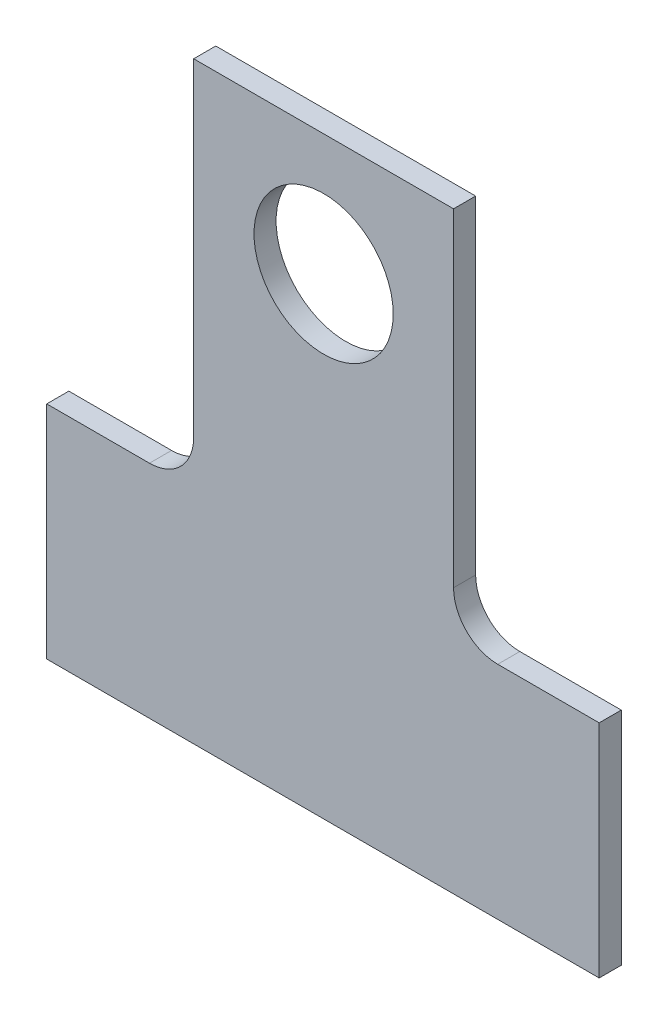
ISO-10303-21;
HEADER;
FILE_DESCRIPTION(('STEP AP214'),'2;1');
FILE_NAME('part.step','',(''),(''),'','','');
FILE_SCHEMA(('AUTOMOTIVE_DESIGN { 1 0 10303 214 1 1 1 1 }'));
ENDSEC;
DATA;
#1=APPLICATION_CONTEXT('core data for automotive mechanical design processes');
#2=APPLICATION_PROTOCOL_DEFINITION('international standard','automotive_design',2000,#1);
#3=PRODUCT_CONTEXT('',#1,'mechanical');
#4=PRODUCT('Part','Part','',(#3));
#5=PRODUCT_RELATED_PRODUCT_CATEGORY('part','',(#4));
#6=PRODUCT_DEFINITION_FORMATION('','',#4);
#7=PRODUCT_DEFINITION_CONTEXT('part definition',#1,'design');
#8=PRODUCT_DEFINITION('design','',#6,#7);
#9=PRODUCT_DEFINITION_SHAPE('','',#8);
#10=(LENGTH_UNIT() NAMED_UNIT(*) SI_UNIT(.MILLI.,.METRE.));
#11=(NAMED_UNIT(*) PLANE_ANGLE_UNIT() SI_UNIT($,.RADIAN.));
#12=(NAMED_UNIT(*) SI_UNIT($,.STERADIAN.) SOLID_ANGLE_UNIT());
#13=UNCERTAINTY_MEASURE_WITH_UNIT(LENGTH_MEASURE(1.E-05),#10,'distance_accuracy_value','');
#14=(GEOMETRIC_REPRESENTATION_CONTEXT(3) GLOBAL_UNCERTAINTY_ASSIGNED_CONTEXT((#13)) GLOBAL_UNIT_ASSIGNED_CONTEXT((#10,
#11,#12)) REPRESENTATION_CONTEXT('',''));
#15=CARTESIAN_POINT('',(0.,0.,0.));
#16=DIRECTION('',(0.,0.,1.));
#17=DIRECTION('',(1.,0.,0.));
#18=AXIS2_PLACEMENT_3D('',#15,#16,#17);
#19=CARTESIAN_POINT('',(-5.85,10.85,1.));
#20=DIRECTION('',(0.,-1.,0.));
#21=DIRECTION('',(0.,0.,-1.));
#22=AXIS2_PLACEMENT_3D('',#19,#20,#21);
#23=PLANE('',#22);
#24=DIRECTION('',(-1.,0.,0.));
#25=VECTOR('',#24,1.);
#26=CARTESIAN_POINT('',(-5.85,10.85,0.));
#27=LINE('',#26,#25);
#28=CARTESIAN_POINT('',(5.91,10.85,0.));
#29=VERTEX_POINT('',#28);
#30=CARTESIAN_POINT('',(-5.85,10.85,0.));
#31=VERTEX_POINT('',#30);
#32=EDGE_CURVE('E146',#29,#31,#27,.T.);
#33=ORIENTED_EDGE('',*,*,#32,.T.);
#34=DIRECTION('',(0.,0.,-1.));
#35=VECTOR('',#34,1.);
#36=CARTESIAN_POINT('',(-5.85,10.85,1.));
#37=LINE('',#36,#35);
#38=CARTESIAN_POINT('',(-5.85,10.85,1.));
#39=VERTEX_POINT('',#38);
#40=EDGE_CURVE('E41',#39,#31,#37,.T.);
#41=ORIENTED_EDGE('',*,*,#40,.F.);
#42=DIRECTION('',(-1.,0.,0.));
#43=VECTOR('',#42,1.);
#44=CARTESIAN_POINT('',(-5.85,10.85,1.));
#45=LINE('',#44,#43);
#46=CARTESIAN_POINT('',(5.91,10.85,1.));
#47=VERTEX_POINT('',#46);
#48=EDGE_CURVE('E100',#47,#39,#45,.T.);
#49=ORIENTED_EDGE('',*,*,#48,.F.);
#50=DIRECTION('',(0.,0.,-1.));
#51=VECTOR('',#50,1.);
#52=CARTESIAN_POINT('',(5.91,10.85,1.));
#53=LINE('',#52,#51);
#54=EDGE_CURVE('E11',#47,#29,#53,.T.);
#55=ORIENTED_EDGE('',*,*,#54,.T.);
#56=EDGE_LOOP('',(#33,#41,#49,#55));
#57=FACE_BOUND('',#56,.T.);
#58=ADVANCED_FACE('F33',(#57),#23,.F.);
#59=CARTESIAN_POINT('',(-5.85,-3.99999999999998,1.));
#60=DIRECTION('',(1.,0.,0.));
#61=DIRECTION('',(0.,0.,-1.));
#62=AXIS2_PLACEMENT_3D('',#59,#60,#61);
#63=PLANE('',#62);
#64=DIRECTION('',(0.,-1.,0.));
#65=VECTOR('',#64,1.);
#66=CARTESIAN_POINT('',(-5.85,-3.99999999999998,0.));
#67=LINE('',#66,#65);
#68=CARTESIAN_POINT('',(-5.85,-3.99999999999998,0.));
#69=VERTEX_POINT('',#68);
#70=EDGE_CURVE('E149',#31,#69,#67,.T.);
#71=ORIENTED_EDGE('',*,*,#70,.T.);
#72=DIRECTION('',(0.,0.,-1.));
#73=VECTOR('',#72,1.);
#74=CARTESIAN_POINT('',(-5.85,-3.99999999999998,1.));
#75=LINE('',#74,#73);
#76=CARTESIAN_POINT('',(-5.85,-3.99999999999998,1.));
#77=VERTEX_POINT('',#76);
#78=EDGE_CURVE('E177',#77,#69,#75,.T.);
#79=ORIENTED_EDGE('',*,*,#78,.F.);
#80=DIRECTION('',(0.,-1.,0.));
#81=VECTOR('',#80,1.);
#82=CARTESIAN_POINT('',(-5.85,6.85,1.));
#83=LINE('',#82,#81);
#84=EDGE_CURVE('E184',#39,#77,#83,.T.);
#85=ORIENTED_EDGE('',*,*,#84,.F.);
#86=ORIENTED_EDGE('',*,*,#40,.T.);
#87=EDGE_LOOP('',(#71,#79,#85,#86));
#88=FACE_BOUND('',#87,.T.);
#89=ADVANCED_FACE('F182',(#88),#63,.F.);
#90=CARTESIAN_POINT('',(-7.85,-4.,1.));
#91=DIRECTION('',(0.,0.,-1.));
#92=DIRECTION('',(-1.,0.,0.));
#93=AXIS2_PLACEMENT_3D('',#90,#91,#92);
#94=CYLINDRICAL_SURFACE('',#93,2.);
#95=CARTESIAN_POINT('',(-7.85,-4.,0.));
#96=DIRECTION('',(0.,0.,-1.));
#97=DIRECTION('',(-1.,0.,0.));
#98=AXIS2_PLACEMENT_3D('',#95,#96,#97);
#99=CIRCLE('',#98,2.);
#100=CARTESIAN_POINT('',(-7.85000000000002,-6.,0.));
#101=VERTEX_POINT('',#100);
#102=EDGE_CURVE('E152',#69,#101,#99,.T.);
#103=ORIENTED_EDGE('',*,*,#102,.T.);
#104=DIRECTION('',(0.,0.,-1.));
#105=VECTOR('',#104,1.);
#106=CARTESIAN_POINT('',(-7.85000000000002,-6.,1.));
#107=LINE('',#106,#105);
#108=CARTESIAN_POINT('',(-7.85000000000002,-6.,1.));
#109=VERTEX_POINT('',#108);
#110=EDGE_CURVE('E174',#109,#101,#107,.T.);
#111=ORIENTED_EDGE('',*,*,#110,.F.);
#112=CARTESIAN_POINT('',(-7.85,-4.,1.));
#113=DIRECTION('',(0.,0.,-1.));
#114=DIRECTION('',(-1.,0.,0.));
#115=AXIS2_PLACEMENT_3D('',#112,#113,#114);
#116=CIRCLE('',#115,2.);
#117=EDGE_CURVE('E200',#77,#109,#116,.T.);
#118=ORIENTED_EDGE('',*,*,#117,.F.);
#119=ORIENTED_EDGE('',*,*,#78,.T.);
#120=EDGE_LOOP('',(#103,#111,#118,#119));
#121=FACE_BOUND('',#120,.T.);
#122=ADVANCED_FACE('F191',(#121),#94,.F.);
#123=CARTESIAN_POINT('',(-7.85000000000002,-6.,1.));
#124=DIRECTION('',(0.,-1.,0.));
#125=DIRECTION('',(0.,0.,-1.));
#126=AXIS2_PLACEMENT_3D('',#123,#124,#125);
#127=PLANE('',#126);
#128=DIRECTION('',(-1.,0.,0.));
#129=VECTOR('',#128,1.);
#130=CARTESIAN_POINT('',(-7.85000000000002,-6.,0.));
#131=LINE('',#130,#129);
#132=CARTESIAN_POINT('',(-12.5,-6.,0.));
#133=VERTEX_POINT('',#132);
#134=EDGE_CURVE('E154',#101,#133,#131,.T.);
#135=ORIENTED_EDGE('',*,*,#134,.T.);
#136=DIRECTION('',(0.,0.,-1.));
#137=VECTOR('',#136,1.);
#138=CARTESIAN_POINT('',(-12.5,-6.,1.));
#139=LINE('',#138,#137);
#140=CARTESIAN_POINT('',(-12.5,-6.,1.));
#141=VERTEX_POINT('',#140);
#142=EDGE_CURVE('E171',#141,#133,#139,.T.);
#143=ORIENTED_EDGE('',*,*,#142,.F.);
#144=DIRECTION('',(-1.,0.,0.));
#145=VECTOR('',#144,1.);
#146=CARTESIAN_POINT('',(-7.85000000000002,-6.,1.));
#147=LINE('',#146,#145);
#148=EDGE_CURVE('E197',#109,#141,#147,.T.);
#149=ORIENTED_EDGE('',*,*,#148,.F.);
#150=ORIENTED_EDGE('',*,*,#110,.T.);
#151=EDGE_LOOP('',(#135,#143,#149,#150));
#152=FACE_BOUND('',#151,.T.);
#153=ADVANCED_FACE('F195',(#152),#127,.F.);
#154=CARTESIAN_POINT('',(-12.5,-6.,1.));
#155=DIRECTION('',(1.,0.,0.));
#156=DIRECTION('',(0.,0.,-1.));
#157=AXIS2_PLACEMENT_3D('',#154,#155,#156);
#158=PLANE('',#157);
#159=DIRECTION('',(0.,-1.,0.));
#160=VECTOR('',#159,1.);
#161=CARTESIAN_POINT('',(-12.5,-6.,0.));
#162=LINE('',#161,#160);
#163=CARTESIAN_POINT('',(-12.5,-16.,0.));
#164=VERTEX_POINT('',#163);
#165=EDGE_CURVE('E156',#133,#164,#162,.T.);
#166=ORIENTED_EDGE('',*,*,#165,.T.);
#167=DIRECTION('',(0.,0.,-1.));
#168=VECTOR('',#167,1.);
#169=CARTESIAN_POINT('',(-12.5,-16.,1.));
#170=LINE('',#169,#168);
#171=CARTESIAN_POINT('',(-12.5,-16.,1.));
#172=VERTEX_POINT('',#171);
#173=EDGE_CURVE('E168',#172,#164,#170,.T.);
#174=ORIENTED_EDGE('',*,*,#173,.F.);
#175=DIRECTION('',(0.,-1.,0.));
#176=VECTOR('',#175,1.);
#177=CARTESIAN_POINT('',(-12.5,-6.,1.));
#178=LINE('',#177,#176);
#179=EDGE_CURVE('E199',#141,#172,#178,.T.);
#180=ORIENTED_EDGE('',*,*,#179,.F.);
#181=ORIENTED_EDGE('',*,*,#142,.T.);
#182=EDGE_LOOP('',(#166,#174,#180,#181));
#183=FACE_BOUND('',#182,.T.);
#184=ADVANCED_FACE('F242',(#183),#158,.F.);
#185=CARTESIAN_POINT('',(-12.5,-16.,1.));
#186=DIRECTION('',(0.,1.,0.));
#187=DIRECTION('',(0.,0.,1.));
#188=AXIS2_PLACEMENT_3D('',#185,#186,#187);
#189=PLANE('',#188);
#190=DIRECTION('',(1.,0.,0.));
#191=VECTOR('',#190,1.);
#192=CARTESIAN_POINT('',(-12.5,-16.,0.));
#193=LINE('',#192,#191);
#194=CARTESIAN_POINT('',(12.5,-16.,0.));
#195=VERTEX_POINT('',#194);
#196=EDGE_CURVE('E158',#164,#195,#193,.T.);
#197=ORIENTED_EDGE('',*,*,#196,.T.);
#198=DIRECTION('',(0.,0.,-1.));
#199=VECTOR('',#198,1.);
#200=CARTESIAN_POINT('',(12.5,-16.,1.));
#201=LINE('',#200,#199);
#202=CARTESIAN_POINT('',(12.5,-16.,1.));
#203=VERTEX_POINT('',#202);
#204=EDGE_CURVE('E135',#203,#195,#201,.T.);
#205=ORIENTED_EDGE('',*,*,#204,.F.);
#206=DIRECTION('',(1.,0.,0.));
#207=VECTOR('',#206,1.);
#208=CARTESIAN_POINT('',(-12.5,-16.,1.));
#209=LINE('',#208,#207);
#210=EDGE_CURVE('E126',#172,#203,#209,.T.);
#211=ORIENTED_EDGE('',*,*,#210,.F.);
#212=ORIENTED_EDGE('',*,*,#173,.T.);
#213=EDGE_LOOP('',(#197,#205,#211,#212));
#214=FACE_BOUND('',#213,.T.);
#215=ADVANCED_FACE('F245',(#214),#189,.F.);
#216=CARTESIAN_POINT('',(12.5,-16.,1.));
#217=DIRECTION('',(-1.,0.,0.));
#218=DIRECTION('',(0.,0.,1.));
#219=AXIS2_PLACEMENT_3D('',#216,#217,#218);
#220=PLANE('',#219);
#221=DIRECTION('',(0.,1.,0.));
#222=VECTOR('',#221,1.);
#223=CARTESIAN_POINT('',(12.5,-16.,0.));
#224=LINE('',#223,#222);
#225=CARTESIAN_POINT('',(12.5,-6.,0.));
#226=VERTEX_POINT('',#225);
#227=EDGE_CURVE('E134',#195,#226,#224,.T.);
#228=ORIENTED_EDGE('',*,*,#227,.T.);
#229=DIRECTION('',(0.,0.,-1.));
#230=VECTOR('',#229,1.);
#231=CARTESIAN_POINT('',(12.5,-6.,1.));
#232=LINE('',#231,#230);
#233=CARTESIAN_POINT('',(12.5,-6.,1.));
#234=VERTEX_POINT('',#233);
#235=EDGE_CURVE('E131',#234,#226,#232,.T.);
#236=ORIENTED_EDGE('',*,*,#235,.F.);
#237=DIRECTION('',(0.,1.,0.));
#238=VECTOR('',#237,1.);
#239=CARTESIAN_POINT('',(12.5,-16.,1.));
#240=LINE('',#239,#238);
#241=EDGE_CURVE('E120',#203,#234,#240,.T.);
#242=ORIENTED_EDGE('',*,*,#241,.F.);
#243=ORIENTED_EDGE('',*,*,#204,.T.);
#244=EDGE_LOOP('',(#228,#236,#242,#243));
#245=FACE_BOUND('',#244,.T.);
#246=ADVANCED_FACE('F132',(#245),#220,.F.);
#247=CARTESIAN_POINT('',(7.91,-6.,1.));
#248=DIRECTION('',(0.,-1.,0.));
#249=DIRECTION('',(1.,0.,0.));
#250=AXIS2_PLACEMENT_3D('',#247,#248,#249);
#251=PLANE('',#250);
#252=DIRECTION('',(-1.,0.,0.));
#253=VECTOR('',#252,1.);
#254=CARTESIAN_POINT('',(7.91,-6.,0.));
#255=LINE('',#254,#253);
#256=CARTESIAN_POINT('',(7.91,-6.,0.));
#257=VERTEX_POINT('',#256);
#258=EDGE_CURVE('E85',#226,#257,#255,.T.);
#259=ORIENTED_EDGE('',*,*,#258,.T.);
#260=DIRECTION('',(0.,0.,-1.));
#261=VECTOR('',#260,1.);
#262=CARTESIAN_POINT('',(7.91,-6.,1.));
#263=LINE('',#262,#261);
#264=CARTESIAN_POINT('',(7.91,-6.,1.));
#265=VERTEX_POINT('',#264);
#266=EDGE_CURVE('E136',#265,#257,#263,.T.);
#267=ORIENTED_EDGE('',*,*,#266,.F.);
#268=DIRECTION('',(-1.,0.,0.));
#269=VECTOR('',#268,1.);
#270=CARTESIAN_POINT('',(7.91,-6.,1.));
#271=LINE('',#270,#269);
#272=EDGE_CURVE('E124',#234,#265,#271,.T.);
#273=ORIENTED_EDGE('',*,*,#272,.F.);
#274=ORIENTED_EDGE('',*,*,#235,.T.);
#275=EDGE_LOOP('',(#259,#267,#273,#274));
#276=FACE_BOUND('',#275,.T.);
#277=ADVANCED_FACE('F138',(#276),#251,.F.);
#278=CARTESIAN_POINT('',(7.91,-4.,1.));
#279=DIRECTION('',(0.,0.,-1.));
#280=DIRECTION('',(-1.,0.,0.));
#281=AXIS2_PLACEMENT_3D('',#278,#279,#280);
#282=CYLINDRICAL_SURFACE('',#281,2.);
#283=CARTESIAN_POINT('',(7.91,-4.,0.));
#284=DIRECTION('',(0.,0.,-1.));
#285=DIRECTION('',(1.,0.,0.));
#286=AXIS2_PLACEMENT_3D('',#283,#284,#285);
#287=CIRCLE('',#286,2.);
#288=CARTESIAN_POINT('',(5.91,-4.,0.));
#289=VERTEX_POINT('',#288);
#290=EDGE_CURVE('E162',#257,#289,#287,.T.);
#291=ORIENTED_EDGE('',*,*,#290,.T.);
#292=DIRECTION('',(0.,0.,-1.));
#293=VECTOR('',#292,1.);
#294=CARTESIAN_POINT('',(5.91,-4.,1.));
#295=LINE('',#294,#293);
#296=CARTESIAN_POINT('',(5.91,-4.,1.));
#297=VERTEX_POINT('',#296);
#298=EDGE_CURVE('E142',#297,#289,#295,.T.);
#299=ORIENTED_EDGE('',*,*,#298,.F.);
#300=CARTESIAN_POINT('',(7.91,-4.,1.));
#301=DIRECTION('',(0.,0.,-1.));
#302=DIRECTION('',(1.,0.,0.));
#303=AXIS2_PLACEMENT_3D('',#300,#301,#302);
#304=CIRCLE('',#303,2.);
#305=EDGE_CURVE('E140',#265,#297,#304,.T.);
#306=ORIENTED_EDGE('',*,*,#305,.F.);
#307=ORIENTED_EDGE('',*,*,#266,.T.);
#308=EDGE_LOOP('',(#291,#299,#306,#307));
#309=FACE_BOUND('',#308,.T.);
#310=ADVANCED_FACE('F229',(#309),#282,.F.);
#311=CARTESIAN_POINT('',(5.91,6.85,1.));
#312=DIRECTION('',(-1.,0.,0.));
#313=DIRECTION('',(0.,0.,1.));
#314=AXIS2_PLACEMENT_3D('',#311,#312,#313);
#315=PLANE('',#314);
#316=DIRECTION('',(0.,1.,0.));
#317=VECTOR('',#316,1.);
#318=CARTESIAN_POINT('',(5.91,6.85,0.));
#319=LINE('',#318,#317);
#320=EDGE_CURVE('E92',#289,#29,#319,.T.);
#321=ORIENTED_EDGE('',*,*,#320,.T.);
#322=ORIENTED_EDGE('',*,*,#54,.F.);
#323=DIRECTION('',(0.,1.,0.));
#324=VECTOR('',#323,1.);
#325=CARTESIAN_POINT('',(5.91,10.85,1.));
#326=LINE('',#325,#324);
#327=EDGE_CURVE('E49',#297,#47,#326,.T.);
#328=ORIENTED_EDGE('',*,*,#327,.F.);
#329=ORIENTED_EDGE('',*,*,#298,.T.);
#330=EDGE_LOOP('',(#321,#322,#328,#329));
#331=FACE_BOUND('',#330,.T.);
#332=ADVANCED_FACE('F222',(#331),#315,.F.);
#333=CARTESIAN_POINT('',(7.91,-4.,1.));
#334=DIRECTION('',(0.,0.,1.));
#335=DIRECTION('',(1.,0.,0.));
#336=AXIS2_PLACEMENT_3D('',#333,#334,#335);
#337=PLANE('',#336);
#338=CARTESIAN_POINT('',(0.0300000000000005,5.36,1.));
#339=DIRECTION('',(0.,0.,1.));
#340=DIRECTION('',(1.,0.,0.));
#341=AXIS2_PLACEMENT_3D('',#338,#339,#340);
#342=CIRCLE('',#341,3.15);
#343=CARTESIAN_POINT('',(3.18,5.36,1.));
#344=VERTEX_POINT('',#343);
#345=EDGE_CURVE('E208',#344,#344,#342,.T.);
#346=ORIENTED_EDGE('',*,*,#345,.F.);
#347=EDGE_LOOP('',(#346));
#348=FACE_BOUND('',#347,.T.);
#349=ORIENTED_EDGE('',*,*,#327,.T.);
#350=ORIENTED_EDGE('',*,*,#48,.T.);
#351=ORIENTED_EDGE('',*,*,#84,.T.);
#352=ORIENTED_EDGE('',*,*,#117,.T.);
#353=ORIENTED_EDGE('',*,*,#148,.T.);
#354=ORIENTED_EDGE('',*,*,#179,.T.);
#355=ORIENTED_EDGE('',*,*,#210,.T.);
#356=ORIENTED_EDGE('',*,*,#241,.T.);
#357=ORIENTED_EDGE('',*,*,#272,.T.);
#358=ORIENTED_EDGE('',*,*,#305,.T.);
#359=EDGE_LOOP('',(#349,#350,#351,#352,#353,#354,#355,#356,#357,#358));
#360=FACE_BOUND('',#359,.T.);
#361=ADVANCED_FACE('F122',(#348,#360),#337,.T.);
#362=CARTESIAN_POINT('',(7.91,-4.,0.));
#363=DIRECTION('',(0.,0.,1.));
#364=DIRECTION('',(1.,0.,0.));
#365=AXIS2_PLACEMENT_3D('',#362,#363,#364);
#366=PLANE('',#365);
#367=CARTESIAN_POINT('',(0.0300000000000005,5.36,0.));
#368=DIRECTION('',(0.,0.,1.));
#369=DIRECTION('',(1.,0.,0.));
#370=AXIS2_PLACEMENT_3D('',#367,#368,#369);
#371=CIRCLE('',#370,3.15);
#372=CARTESIAN_POINT('',(3.18,5.36,0.));
#373=VERTEX_POINT('',#372);
#374=EDGE_CURVE('E150',#373,#373,#371,.T.);
#375=ORIENTED_EDGE('',*,*,#374,.T.);
#376=EDGE_LOOP('',(#375));
#377=FACE_BOUND('',#376,.T.);
#378=ORIENTED_EDGE('',*,*,#32,.F.);
#379=ORIENTED_EDGE('',*,*,#320,.F.);
#380=ORIENTED_EDGE('',*,*,#290,.F.);
#381=ORIENTED_EDGE('',*,*,#258,.F.);
#382=ORIENTED_EDGE('',*,*,#227,.F.);
#383=ORIENTED_EDGE('',*,*,#196,.F.);
#384=ORIENTED_EDGE('',*,*,#165,.F.);
#385=ORIENTED_EDGE('',*,*,#134,.F.);
#386=ORIENTED_EDGE('',*,*,#102,.F.);
#387=ORIENTED_EDGE('',*,*,#70,.F.);
#388=EDGE_LOOP('',(#378,#379,#380,#381,#382,#383,#384,#385,#386,#387));
#389=FACE_BOUND('',#388,.T.);
#390=ADVANCED_FACE('F185',(#377,#389),#366,.F.);
#391=CARTESIAN_POINT('',(0.0300000000000005,5.36,0.));
#392=DIRECTION('',(0.,0.,1.));
#393=DIRECTION('',(1.,0.,0.));
#394=AXIS2_PLACEMENT_3D('',#391,#392,#393);
#395=CYLINDRICAL_SURFACE('',#394,3.15);
#396=ORIENTED_EDGE('',*,*,#374,.F.);
#397=EDGE_LOOP('',(#396));
#398=FACE_BOUND('',#397,.T.);
#399=ORIENTED_EDGE('',*,*,#345,.T.);
#400=EDGE_LOOP('',(#399));
#401=FACE_BOUND('',#400,.T.);
#402=ADVANCED_FACE('F215',(#398,#401),#395,.F.);
#403=CLOSED_SHELL('',(#58,#89,#122,#153,#184,#215,#246,#277,#310,#332,#361,#390,#402));
#404=MANIFOLD_SOLID_BREP('B2',#403);
#405=ADVANCED_BREP_SHAPE_REPRESENTATION('',(#18,#404),#14);
#406=SHAPE_DEFINITION_REPRESENTATION(#9,#405);
ENDSEC;
END-ISO-10303-21;
